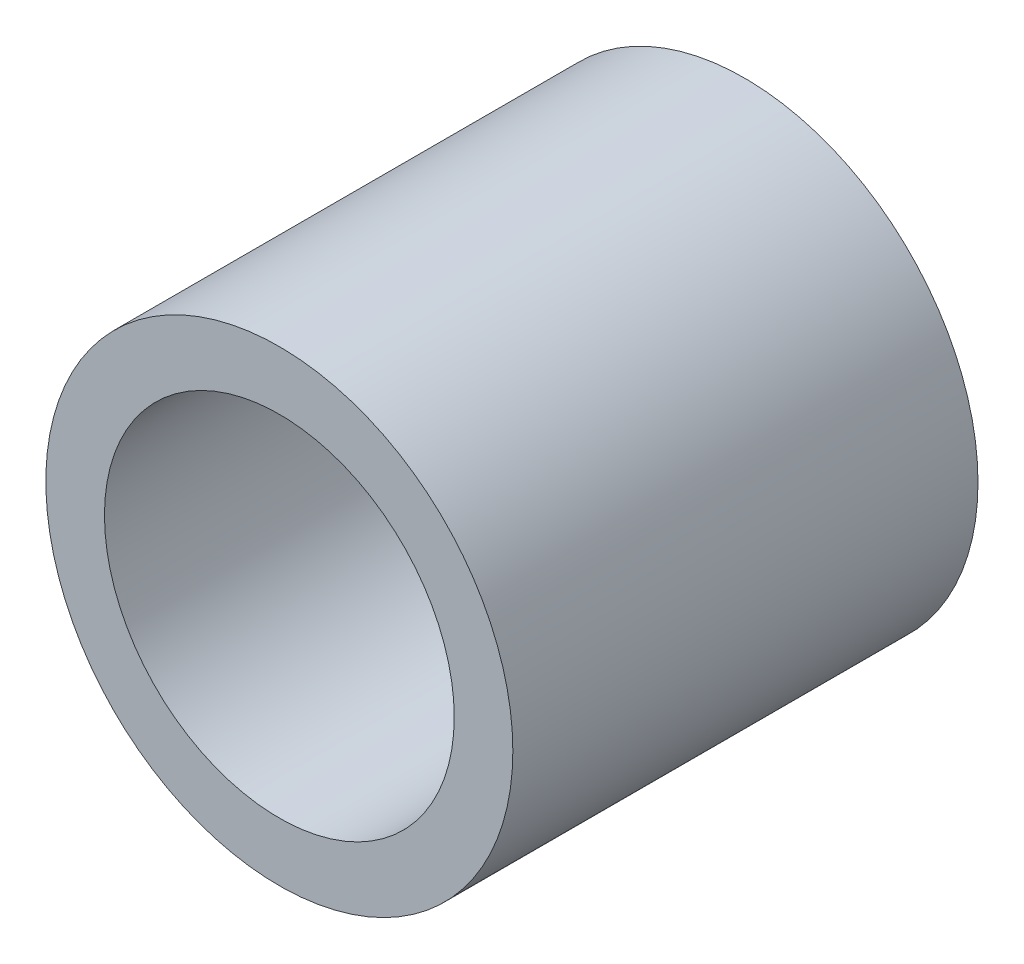
ISO-10303-21;
HEADER;
FILE_DESCRIPTION(('STEP AP214'),'2;1');
FILE_NAME('part.step','',(''),(''),'','','');
FILE_SCHEMA(('AUTOMOTIVE_DESIGN { 1 0 10303 214 1 1 1 1 }'));
ENDSEC;
DATA;
#1=APPLICATION_CONTEXT('core data for automotive mechanical design processes');
#2=APPLICATION_PROTOCOL_DEFINITION('international standard','automotive_design',2000,#1);
#3=PRODUCT_CONTEXT('',#1,'mechanical');
#4=PRODUCT('Part','Part','',(#3));
#5=PRODUCT_RELATED_PRODUCT_CATEGORY('part','',(#4));
#6=PRODUCT_DEFINITION_FORMATION('','',#4);
#7=PRODUCT_DEFINITION_CONTEXT('part definition',#1,'design');
#8=PRODUCT_DEFINITION('design','',#6,#7);
#9=PRODUCT_DEFINITION_SHAPE('','',#8);
#10=(LENGTH_UNIT() NAMED_UNIT(*) SI_UNIT(.MILLI.,.METRE.));
#11=(NAMED_UNIT(*) PLANE_ANGLE_UNIT() SI_UNIT($,.RADIAN.));
#12=(NAMED_UNIT(*) SI_UNIT($,.STERADIAN.) SOLID_ANGLE_UNIT());
#13=UNCERTAINTY_MEASURE_WITH_UNIT(LENGTH_MEASURE(1.E-05),#10,'distance_accuracy_value','');
#14=(GEOMETRIC_REPRESENTATION_CONTEXT(3) GLOBAL_UNCERTAINTY_ASSIGNED_CONTEXT((#13)) GLOBAL_UNIT_ASSIGNED_CONTEXT((#10,
#11,#12)) REPRESENTATION_CONTEXT('',''));
#15=CARTESIAN_POINT('',(0.,0.,0.));
#16=DIRECTION('',(0.,0.,1.));
#17=DIRECTION('',(1.,0.,0.));
#18=AXIS2_PLACEMENT_3D('',#15,#16,#17);
#19=CARTESIAN_POINT('',(0.,0.,6.35));
#20=DIRECTION('',(0.,0.,1.));
#21=DIRECTION('',(1.,0.,0.));
#22=AXIS2_PLACEMENT_3D('',#19,#20,#21);
#23=PLANE('',#22);
#24=CARTESIAN_POINT('',(0.,0.,6.35));
#25=DIRECTION('',(0.,0.,1.));
#26=DIRECTION('',(1.,0.,0.));
#27=AXIS2_PLACEMENT_3D('',#24,#25,#26);
#28=CIRCLE('',#27,6.3754);
#29=CARTESIAN_POINT('',(6.3754,0.,6.35));
#30=VERTEX_POINT('',#29);
#31=EDGE_CURVE('E10',#30,#30,#28,.T.);
#32=ORIENTED_EDGE('',*,*,#31,.T.);
#33=EDGE_LOOP('',(#32));
#34=FACE_BOUND('',#33,.T.);
#35=CARTESIAN_POINT('',(0.,0.,6.35));
#36=DIRECTION('',(0.,0.,1.));
#37=DIRECTION('',(1.,0.,0.));
#38=AXIS2_PLACEMENT_3D('',#35,#36,#37);
#39=CIRCLE('',#38,4.7752);
#40=CARTESIAN_POINT('',(4.7752,0.,6.35));
#41=VERTEX_POINT('',#40);
#42=EDGE_CURVE('E43',#41,#41,#39,.T.);
#43=ORIENTED_EDGE('',*,*,#42,.F.);
#44=EDGE_LOOP('',(#43));
#45=FACE_BOUND('',#44,.T.);
#46=ADVANCED_FACE('F32',(#34,#45),#23,.T.);
#47=CARTESIAN_POINT('',(0.,0.,-6.35));
#48=DIRECTION('',(0.,0.,1.));
#49=DIRECTION('',(1.,0.,0.));
#50=AXIS2_PLACEMENT_3D('',#47,#48,#49);
#51=PLANE('',#50);
#52=CARTESIAN_POINT('',(0.,0.,-6.35));
#53=DIRECTION('',(0.,0.,1.));
#54=DIRECTION('',(1.,0.,0.));
#55=AXIS2_PLACEMENT_3D('',#52,#53,#54);
#56=CIRCLE('',#55,6.3754);
#57=CARTESIAN_POINT('',(6.3754,0.,-6.35));
#58=VERTEX_POINT('',#57);
#59=EDGE_CURVE('E36',#58,#58,#56,.T.);
#60=ORIENTED_EDGE('',*,*,#59,.F.);
#61=EDGE_LOOP('',(#60));
#62=FACE_BOUND('',#61,.T.);
#63=CARTESIAN_POINT('',(0.,0.,-6.35));
#64=DIRECTION('',(0.,0.,1.));
#65=DIRECTION('',(1.,0.,0.));
#66=AXIS2_PLACEMENT_3D('',#63,#64,#65);
#67=CIRCLE('',#66,4.7752);
#68=CARTESIAN_POINT('',(4.7752,0.,-6.35));
#69=VERTEX_POINT('',#68);
#70=EDGE_CURVE('E45',#69,#69,#67,.T.);
#71=ORIENTED_EDGE('',*,*,#70,.T.);
#72=EDGE_LOOP('',(#71));
#73=FACE_BOUND('',#72,.T.);
#74=ADVANCED_FACE('F55',(#62,#73),#51,.F.);
#75=CARTESIAN_POINT('',(0.,0.,6.35));
#76=DIRECTION('',(0.,0.,-1.));
#77=DIRECTION('',(-1.,0.,0.));
#78=AXIS2_PLACEMENT_3D('',#75,#76,#77);
#79=CYLINDRICAL_SURFACE('',#78,6.3754);
#80=ORIENTED_EDGE('',*,*,#31,.F.);
#81=EDGE_LOOP('',(#80));
#82=FACE_BOUND('',#81,.T.);
#83=ORIENTED_EDGE('',*,*,#59,.T.);
#84=EDGE_LOOP('',(#83));
#85=FACE_BOUND('',#84,.T.);
#86=ADVANCED_FACE('F34',(#82,#85),#79,.T.);
#87=CARTESIAN_POINT('',(0.,0.,6.35));
#88=DIRECTION('',(0.,0.,-1.));
#89=DIRECTION('',(-1.,0.,0.));
#90=AXIS2_PLACEMENT_3D('',#87,#88,#89);
#91=CYLINDRICAL_SURFACE('',#90,4.7752);
#92=ORIENTED_EDGE('',*,*,#42,.T.);
#93=EDGE_LOOP('',(#92));
#94=FACE_BOUND('',#93,.T.);
#95=ORIENTED_EDGE('',*,*,#70,.F.);
#96=EDGE_LOOP('',(#95));
#97=FACE_BOUND('',#96,.T.);
#98=ADVANCED_FACE('F51',(#94,#97),#91,.F.);
#99=CLOSED_SHELL('',(#46,#74,#86,#98));
#100=MANIFOLD_SOLID_BREP('B2',#99);
#101=ADVANCED_BREP_SHAPE_REPRESENTATION('',(#18,#100),#14);
#102=SHAPE_DEFINITION_REPRESENTATION(#9,#101);
ENDSEC;
END-ISO-10303-21;
